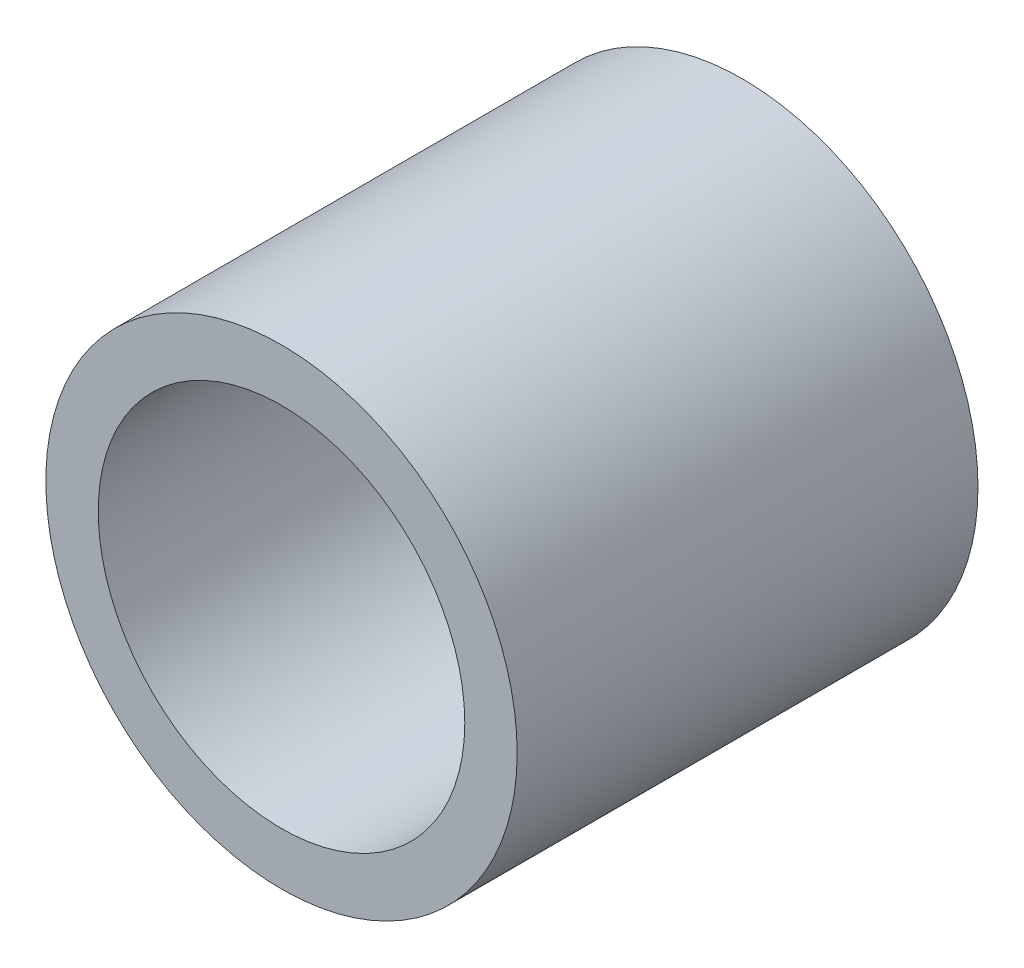
ISO-10303-21;
HEADER;
FILE_DESCRIPTION(('STEP AP214'),'2;1');
FILE_NAME('part.step','',(''),(''),'','','');
FILE_SCHEMA(('AUTOMOTIVE_DESIGN { 1 0 10303 214 1 1 1 1 }'));
ENDSEC;
DATA;
#1=APPLICATION_CONTEXT('core data for automotive mechanical design processes');
#2=APPLICATION_PROTOCOL_DEFINITION('international standard','automotive_design',2000,#1);
#3=PRODUCT_CONTEXT('',#1,'mechanical');
#4=PRODUCT('Part','Part','',(#3));
#5=PRODUCT_RELATED_PRODUCT_CATEGORY('part','',(#4));
#6=PRODUCT_DEFINITION_FORMATION('','',#4);
#7=PRODUCT_DEFINITION_CONTEXT('part definition',#1,'design');
#8=PRODUCT_DEFINITION('design','',#6,#7);
#9=PRODUCT_DEFINITION_SHAPE('','',#8);
#10=(LENGTH_UNIT() NAMED_UNIT(*) SI_UNIT(.MILLI.,.METRE.));
#11=(NAMED_UNIT(*) PLANE_ANGLE_UNIT() SI_UNIT($,.RADIAN.));
#12=(NAMED_UNIT(*) SI_UNIT($,.STERADIAN.) SOLID_ANGLE_UNIT());
#13=UNCERTAINTY_MEASURE_WITH_UNIT(LENGTH_MEASURE(1.E-05),#10,'distance_accuracy_value','');
#14=(GEOMETRIC_REPRESENTATION_CONTEXT(3) GLOBAL_UNCERTAINTY_ASSIGNED_CONTEXT((#13)) GLOBAL_UNIT_ASSIGNED_CONTEXT((#10,
#11,#12)) REPRESENTATION_CONTEXT('',''));
#15=CARTESIAN_POINT('',(0.,0.,0.));
#16=DIRECTION('',(0.,0.,1.));
#17=DIRECTION('',(1.,0.,0.));
#18=AXIS2_PLACEMENT_3D('',#15,#16,#17);
#19=CARTESIAN_POINT('',(0.,0.,11.));
#20=DIRECTION('',(0.,0.,1.));
#21=DIRECTION('',(1.,0.,0.));
#22=AXIS2_PLACEMENT_3D('',#19,#20,#21);
#23=PLANE('',#22);
#24=CARTESIAN_POINT('',(0.,0.,11.));
#25=DIRECTION('',(0.,0.,1.));
#26=DIRECTION('',(1.,0.,0.));
#27=AXIS2_PLACEMENT_3D('',#24,#25,#26);
#28=CIRCLE('',#27,5.625);
#29=CARTESIAN_POINT('',(5.625,0.,11.));
#30=VERTEX_POINT('',#29);
#31=EDGE_CURVE('E10',#30,#30,#28,.T.);
#32=ORIENTED_EDGE('',*,*,#31,.T.);
#33=EDGE_LOOP('',(#32));
#34=FACE_BOUND('',#33,.T.);
#35=CARTESIAN_POINT('',(0.,0.,11.));
#36=DIRECTION('',(0.,0.,1.));
#37=DIRECTION('',(1.,0.,0.));
#38=AXIS2_PLACEMENT_3D('',#35,#36,#37);
#39=CIRCLE('',#38,4.375);
#40=CARTESIAN_POINT('',(4.375,0.,11.));
#41=VERTEX_POINT('',#40);
#42=EDGE_CURVE('E39',#41,#41,#39,.T.);
#43=ORIENTED_EDGE('',*,*,#42,.F.);
#44=EDGE_LOOP('',(#43));
#45=FACE_BOUND('',#44,.T.);
#46=ADVANCED_FACE('F28',(#34,#45),#23,.T.);
#47=CARTESIAN_POINT('',(0.,0.,0.));
#48=DIRECTION('',(0.,0.,1.));
#49=DIRECTION('',(1.,0.,0.));
#50=AXIS2_PLACEMENT_3D('',#47,#48,#49);
#51=PLANE('',#50);
#52=CARTESIAN_POINT('',(0.,0.,0.));
#53=DIRECTION('',(0.,0.,1.));
#54=DIRECTION('',(1.,0.,0.));
#55=AXIS2_PLACEMENT_3D('',#52,#53,#54);
#56=CIRCLE('',#55,5.625);
#57=CARTESIAN_POINT('',(5.625,0.,0.));
#58=VERTEX_POINT('',#57);
#59=EDGE_CURVE('E32',#58,#58,#56,.T.);
#60=ORIENTED_EDGE('',*,*,#59,.F.);
#61=EDGE_LOOP('',(#60));
#62=FACE_BOUND('',#61,.T.);
#63=CARTESIAN_POINT('',(0.,0.,0.));
#64=DIRECTION('',(0.,0.,1.));
#65=DIRECTION('',(1.,0.,0.));
#66=AXIS2_PLACEMENT_3D('',#63,#64,#65);
#67=CIRCLE('',#66,4.375);
#68=CARTESIAN_POINT('',(4.375,0.,0.));
#69=VERTEX_POINT('',#68);
#70=EDGE_CURVE('E41',#69,#69,#67,.T.);
#71=ORIENTED_EDGE('',*,*,#70,.T.);
#72=EDGE_LOOP('',(#71));
#73=FACE_BOUND('',#72,.T.);
#74=ADVANCED_FACE('F51',(#62,#73),#51,.F.);
#75=CARTESIAN_POINT('',(0.,0.,11.));
#76=DIRECTION('',(0.,0.,-1.));
#77=DIRECTION('',(-1.,0.,0.));
#78=AXIS2_PLACEMENT_3D('',#75,#76,#77);
#79=CYLINDRICAL_SURFACE('',#78,5.625);
#80=ORIENTED_EDGE('',*,*,#31,.F.);
#81=EDGE_LOOP('',(#80));
#82=FACE_BOUND('',#81,.T.);
#83=ORIENTED_EDGE('',*,*,#59,.T.);
#84=EDGE_LOOP('',(#83));
#85=FACE_BOUND('',#84,.T.);
#86=ADVANCED_FACE('F30',(#82,#85),#79,.T.);
#87=CARTESIAN_POINT('',(0.,0.,11.));
#88=DIRECTION('',(0.,0.,-1.));
#89=DIRECTION('',(-1.,0.,0.));
#90=AXIS2_PLACEMENT_3D('',#87,#88,#89);
#91=CYLINDRICAL_SURFACE('',#90,4.375);
#92=ORIENTED_EDGE('',*,*,#42,.T.);
#93=EDGE_LOOP('',(#92));
#94=FACE_BOUND('',#93,.T.);
#95=ORIENTED_EDGE('',*,*,#70,.F.);
#96=EDGE_LOOP('',(#95));
#97=FACE_BOUND('',#96,.T.);
#98=ADVANCED_FACE('F47',(#94,#97),#91,.F.);
#99=CLOSED_SHELL('',(#46,#74,#86,#98));
#100=MANIFOLD_SOLID_BREP('B2',#99);
#101=ADVANCED_BREP_SHAPE_REPRESENTATION('',(#18,#100),#14);
#102=SHAPE_DEFINITION_REPRESENTATION(#9,#101);
ENDSEC;
END-ISO-10303-21;
